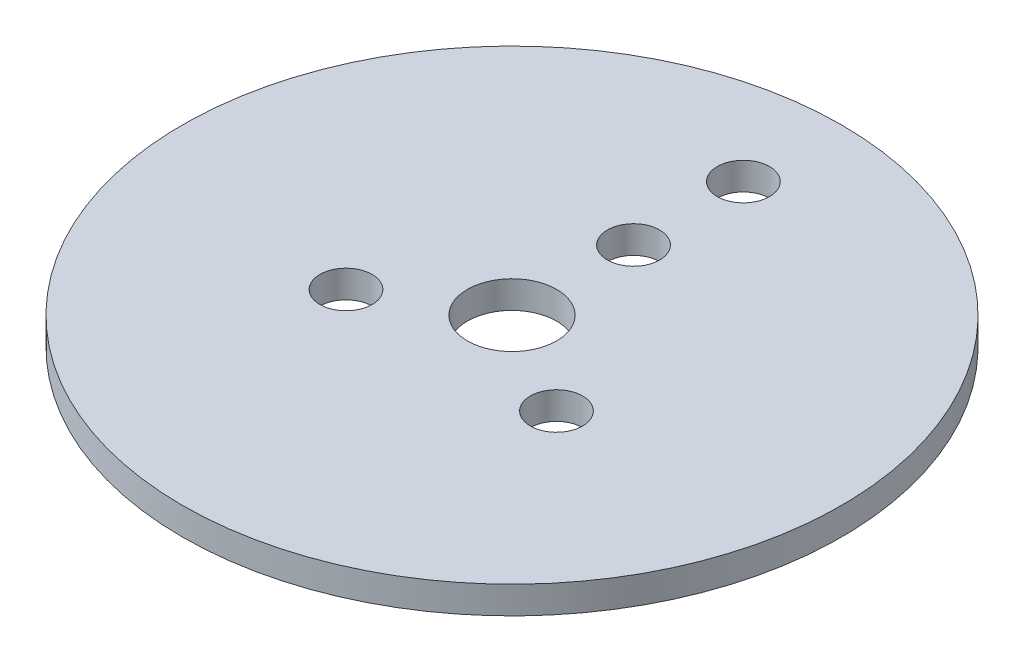
ISO-10303-21;
HEADER;
FILE_DESCRIPTION(('STEP AP214'),'2;1');
FILE_NAME('part.step','',(''),(''),'','','');
FILE_SCHEMA(('AUTOMOTIVE_DESIGN { 1 0 10303 214 1 1 1 1 }'));
ENDSEC;
DATA;
#1=APPLICATION_CONTEXT('core data for automotive mechanical design processes');
#2=APPLICATION_PROTOCOL_DEFINITION('international standard','automotive_design',2000,#1);
#3=PRODUCT_CONTEXT('',#1,'mechanical');
#4=PRODUCT('Part','Part','',(#3));
#5=PRODUCT_RELATED_PRODUCT_CATEGORY('part','',(#4));
#6=PRODUCT_DEFINITION_FORMATION('','',#4);
#7=PRODUCT_DEFINITION_CONTEXT('part definition',#1,'design');
#8=PRODUCT_DEFINITION('design','',#6,#7);
#9=PRODUCT_DEFINITION_SHAPE('','',#8);
#10=(LENGTH_UNIT() NAMED_UNIT(*) SI_UNIT(.MILLI.,.METRE.));
#11=(NAMED_UNIT(*) PLANE_ANGLE_UNIT() SI_UNIT($,.RADIAN.));
#12=(NAMED_UNIT(*) SI_UNIT($,.STERADIAN.) SOLID_ANGLE_UNIT());
#13=UNCERTAINTY_MEASURE_WITH_UNIT(LENGTH_MEASURE(1.E-05),#10,'distance_accuracy_value','');
#14=(GEOMETRIC_REPRESENTATION_CONTEXT(3) GLOBAL_UNCERTAINTY_ASSIGNED_CONTEXT((#13)) GLOBAL_UNIT_ASSIGNED_CONTEXT((#10,
#11,#12)) REPRESENTATION_CONTEXT('',''));
#15=CARTESIAN_POINT('',(0.,0.,0.));
#16=DIRECTION('',(0.,0.,1.));
#17=DIRECTION('',(1.,0.,0.));
#18=AXIS2_PLACEMENT_3D('',#15,#16,#17);
#19=CARTESIAN_POINT('',(0.,2.,0.));
#20=DIRECTION('',(0.,-1.,0.));
#21=DIRECTION('',(0.,0.,-1.));
#22=AXIS2_PLACEMENT_3D('',#19,#20,#21);
#23=CYLINDRICAL_SURFACE('',#22,24.);
#24=CARTESIAN_POINT('',(0.,2.,0.));
#25=DIRECTION('',(0.,1.,0.));
#26=DIRECTION('',(0.,0.,1.));
#27=AXIS2_PLACEMENT_3D('',#24,#25,#26);
#28=CIRCLE('',#27,24.);
#29=CARTESIAN_POINT('',(0.,2.,24.));
#30=VERTEX_POINT('',#29);
#31=EDGE_CURVE('E10',#30,#30,#28,.T.);
#32=ORIENTED_EDGE('',*,*,#31,.F.);
#33=EDGE_LOOP('',(#32));
#34=FACE_BOUND('',#33,.T.);
#35=CARTESIAN_POINT('',(0.,0.,0.));
#36=DIRECTION('',(0.,1.,0.));
#37=DIRECTION('',(0.,0.,1.));
#38=AXIS2_PLACEMENT_3D('',#35,#36,#37);
#39=CIRCLE('',#38,24.);
#40=CARTESIAN_POINT('',(0.,0.,24.));
#41=VERTEX_POINT('',#40);
#42=EDGE_CURVE('E37',#41,#41,#39,.T.);
#43=ORIENTED_EDGE('',*,*,#42,.T.);
#44=EDGE_LOOP('',(#43));
#45=FACE_BOUND('',#44,.T.);
#46=ADVANCED_FACE('F34',(#34,#45),#23,.T.);
#47=CARTESIAN_POINT('',(0.,2.,0.));
#48=DIRECTION('',(0.,1.,0.));
#49=DIRECTION('',(0.,0.,1.));
#50=AXIS2_PLACEMENT_3D('',#47,#48,#49);
#51=PLANE('',#50);
#52=CARTESIAN_POINT('',(0.,2.,-16.85));
#53=DIRECTION('',(0.,1.,0.));
#54=DIRECTION('',(0.,0.,1.));
#55=AXIS2_PLACEMENT_3D('',#52,#53,#54);
#56=CIRCLE('',#55,1.9);
#57=CARTESIAN_POINT('',(0.,2.,-14.95));
#58=VERTEX_POINT('',#57);
#59=EDGE_CURVE('E52',#58,#58,#56,.T.);
#60=ORIENTED_EDGE('',*,*,#59,.F.);
#61=EDGE_LOOP('',(#60));
#62=FACE_BOUND('',#61,.T.);
#63=CARTESIAN_POINT('',(0.,2.,-8.85));
#64=DIRECTION('',(0.,1.,0.));
#65=DIRECTION('',(0.,0.,1.));
#66=AXIS2_PLACEMENT_3D('',#63,#64,#65);
#67=CIRCLE('',#66,1.9);
#68=CARTESIAN_POINT('',(0.,2.,-6.95));
#69=VERTEX_POINT('',#68);
#70=EDGE_CURVE('E58',#69,#69,#67,.T.);
#71=ORIENTED_EDGE('',*,*,#70,.F.);
#72=EDGE_LOOP('',(#71));
#73=FACE_BOUND('',#72,.T.);
#74=CARTESIAN_POINT('',(7.66432482349296,2.,4.42499999999961));
#75=DIRECTION('',(0.,1.,0.));
#76=DIRECTION('',(0.,0.,1.));
#77=AXIS2_PLACEMENT_3D('',#74,#75,#76);
#78=CIRCLE('',#77,1.9);
#79=CARTESIAN_POINT('',(7.66432482349296,2.,6.3249999999996));
#80=VERTEX_POINT('',#79);
#81=EDGE_CURVE('E64',#80,#80,#78,.T.);
#82=ORIENTED_EDGE('',*,*,#81,.F.);
#83=EDGE_LOOP('',(#82));
#84=FACE_BOUND('',#83,.T.);
#85=CARTESIAN_POINT('',(-7.6643248234916,2.,4.42500000000039));
#86=DIRECTION('',(0.,1.,0.));
#87=DIRECTION('',(0.,0.,1.));
#88=AXIS2_PLACEMENT_3D('',#85,#86,#87);
#89=CIRCLE('',#88,1.9);
#90=CARTESIAN_POINT('',(-7.6643248234916,2.,6.32500000000039));
#91=VERTEX_POINT('',#90);
#92=EDGE_CURVE('E70',#91,#91,#89,.T.);
#93=ORIENTED_EDGE('',*,*,#92,.F.);
#94=EDGE_LOOP('',(#93));
#95=FACE_BOUND('',#94,.T.);
#96=CARTESIAN_POINT('',(0.,2.,0.));
#97=DIRECTION('',(0.,1.,0.));
#98=DIRECTION('',(0.,0.,1.));
#99=AXIS2_PLACEMENT_3D('',#96,#97,#98);
#100=CIRCLE('',#99,3.25);
#101=CARTESIAN_POINT('',(0.,2.,3.25));
#102=VERTEX_POINT('',#101);
#103=EDGE_CURVE('E46',#102,#102,#100,.T.);
#104=ORIENTED_EDGE('',*,*,#103,.F.);
#105=EDGE_LOOP('',(#104));
#106=FACE_BOUND('',#105,.T.);
#107=ORIENTED_EDGE('',*,*,#31,.T.);
#108=EDGE_LOOP('',(#107));
#109=FACE_BOUND('',#108,.T.);
#110=ADVANCED_FACE('F87',(#62,#73,#84,#95,#106,#109),#51,.T.);
#111=CARTESIAN_POINT('',(0.,0.,0.));
#112=DIRECTION('',(0.,1.,0.));
#113=DIRECTION('',(0.,0.,1.));
#114=AXIS2_PLACEMENT_3D('',#111,#112,#113);
#115=PLANE('',#114);
#116=CARTESIAN_POINT('',(0.,0.,-16.85));
#117=DIRECTION('',(0.,1.,0.));
#118=DIRECTION('',(0.,0.,1.));
#119=AXIS2_PLACEMENT_3D('',#116,#117,#118);
#120=CIRCLE('',#119,1.9);
#121=CARTESIAN_POINT('',(0.,0.,-14.95));
#122=VERTEX_POINT('',#121);
#123=EDGE_CURVE('E55',#122,#122,#120,.T.);
#124=ORIENTED_EDGE('',*,*,#123,.T.);
#125=EDGE_LOOP('',(#124));
#126=FACE_BOUND('',#125,.T.);
#127=CARTESIAN_POINT('',(0.,0.,-8.85));
#128=DIRECTION('',(0.,1.,0.));
#129=DIRECTION('',(0.,0.,1.));
#130=AXIS2_PLACEMENT_3D('',#127,#128,#129);
#131=CIRCLE('',#130,1.9);
#132=CARTESIAN_POINT('',(0.,0.,-6.95));
#133=VERTEX_POINT('',#132);
#134=EDGE_CURVE('E61',#133,#133,#131,.T.);
#135=ORIENTED_EDGE('',*,*,#134,.T.);
#136=EDGE_LOOP('',(#135));
#137=FACE_BOUND('',#136,.T.);
#138=CARTESIAN_POINT('',(7.66432482349296,0.,4.42499999999961));
#139=DIRECTION('',(0.,1.,0.));
#140=DIRECTION('',(0.,0.,1.));
#141=AXIS2_PLACEMENT_3D('',#138,#139,#140);
#142=CIRCLE('',#141,1.9);
#143=CARTESIAN_POINT('',(7.66432482349296,0.,6.3249999999996));
#144=VERTEX_POINT('',#143);
#145=EDGE_CURVE('E67',#144,#144,#142,.T.);
#146=ORIENTED_EDGE('',*,*,#145,.T.);
#147=EDGE_LOOP('',(#146));
#148=FACE_BOUND('',#147,.T.);
#149=CARTESIAN_POINT('',(-7.6643248234916,0.,4.42500000000039));
#150=DIRECTION('',(0.,1.,0.));
#151=DIRECTION('',(0.,0.,1.));
#152=AXIS2_PLACEMENT_3D('',#149,#150,#151);
#153=CIRCLE('',#152,1.9);
#154=CARTESIAN_POINT('',(-7.6643248234916,0.,6.32500000000039));
#155=VERTEX_POINT('',#154);
#156=EDGE_CURVE('E49',#155,#155,#153,.T.);
#157=ORIENTED_EDGE('',*,*,#156,.T.);
#158=EDGE_LOOP('',(#157));
#159=FACE_BOUND('',#158,.T.);
#160=CARTESIAN_POINT('',(0.,0.,0.));
#161=DIRECTION('',(0.,1.,0.));
#162=DIRECTION('',(0.,0.,1.));
#163=AXIS2_PLACEMENT_3D('',#160,#161,#162);
#164=CIRCLE('',#163,3.25);
#165=CARTESIAN_POINT('',(0.,0.,3.25));
#166=VERTEX_POINT('',#165);
#167=EDGE_CURVE('E44',#166,#166,#164,.T.);
#168=ORIENTED_EDGE('',*,*,#167,.T.);
#169=EDGE_LOOP('',(#168));
#170=FACE_BOUND('',#169,.T.);
#171=ORIENTED_EDGE('',*,*,#42,.F.);
#172=EDGE_LOOP('',(#171));
#173=FACE_BOUND('',#172,.T.);
#174=ADVANCED_FACE('F76',(#126,#137,#148,#159,#170,#173),#115,.F.);
#175=CARTESIAN_POINT('',(0.,0.,0.));
#176=DIRECTION('',(0.,1.,0.));
#177=DIRECTION('',(0.,0.,1.));
#178=AXIS2_PLACEMENT_3D('',#175,#176,#177);
#179=CYLINDRICAL_SURFACE('',#178,3.25);
#180=ORIENTED_EDGE('',*,*,#167,.F.);
#181=EDGE_LOOP('',(#180));
#182=FACE_BOUND('',#181,.T.);
#183=ORIENTED_EDGE('',*,*,#103,.T.);
#184=EDGE_LOOP('',(#183));
#185=FACE_BOUND('',#184,.T.);
#186=ADVANCED_FACE('F83',(#182,#185),#179,.F.);
#187=CARTESIAN_POINT('',(-7.6643248234916,0.,4.42500000000039));
#188=DIRECTION('',(0.,1.,0.));
#189=DIRECTION('',(0.,0.,1.));
#190=AXIS2_PLACEMENT_3D('',#187,#188,#189);
#191=CYLINDRICAL_SURFACE('',#190,1.9);
#192=ORIENTED_EDGE('',*,*,#156,.F.);
#193=EDGE_LOOP('',(#192));
#194=FACE_BOUND('',#193,.T.);
#195=ORIENTED_EDGE('',*,*,#92,.T.);
#196=EDGE_LOOP('',(#195));
#197=FACE_BOUND('',#196,.T.);
#198=ADVANCED_FACE('F79',(#194,#197),#191,.F.);
#199=CARTESIAN_POINT('',(7.66432482349296,0.,4.42499999999961));
#200=DIRECTION('',(0.,1.,0.));
#201=DIRECTION('',(0.,0.,1.));
#202=AXIS2_PLACEMENT_3D('',#199,#200,#201);
#203=CYLINDRICAL_SURFACE('',#202,1.9);
#204=ORIENTED_EDGE('',*,*,#145,.F.);
#205=EDGE_LOOP('',(#204));
#206=FACE_BOUND('',#205,.T.);
#207=ORIENTED_EDGE('',*,*,#81,.T.);
#208=EDGE_LOOP('',(#207));
#209=FACE_BOUND('',#208,.T.);
#210=ADVANCED_FACE('F82',(#206,#209),#203,.F.);
#211=CARTESIAN_POINT('',(0.,0.,-8.85));
#212=DIRECTION('',(0.,1.,0.));
#213=DIRECTION('',(0.,0.,1.));
#214=AXIS2_PLACEMENT_3D('',#211,#212,#213);
#215=CYLINDRICAL_SURFACE('',#214,1.9);
#216=ORIENTED_EDGE('',*,*,#134,.F.);
#217=EDGE_LOOP('',(#216));
#218=FACE_BOUND('',#217,.T.);
#219=ORIENTED_EDGE('',*,*,#70,.T.);
#220=EDGE_LOOP('',(#219));
#221=FACE_BOUND('',#220,.T.);
#222=ADVANCED_FACE('F137',(#218,#221),#215,.F.);
#223=CARTESIAN_POINT('',(0.,0.,-16.85));
#224=DIRECTION('',(0.,1.,0.));
#225=DIRECTION('',(0.,0.,1.));
#226=AXIS2_PLACEMENT_3D('',#223,#224,#225);
#227=CYLINDRICAL_SURFACE('',#226,1.9);
#228=ORIENTED_EDGE('',*,*,#123,.F.);
#229=EDGE_LOOP('',(#228));
#230=FACE_BOUND('',#229,.T.);
#231=ORIENTED_EDGE('',*,*,#59,.T.);
#232=EDGE_LOOP('',(#231));
#233=FACE_BOUND('',#232,.T.);
#234=ADVANCED_FACE('F147',(#230,#233),#227,.F.);
#235=CLOSED_SHELL('',(#46,#110,#174,#186,#198,#210,#222,#234));
#236=MANIFOLD_SOLID_BREP('B2',#235);
#237=ADVANCED_BREP_SHAPE_REPRESENTATION('',(#18,#236),#14);
#238=SHAPE_DEFINITION_REPRESENTATION(#9,#237);
ENDSEC;
END-ISO-10303-21;
